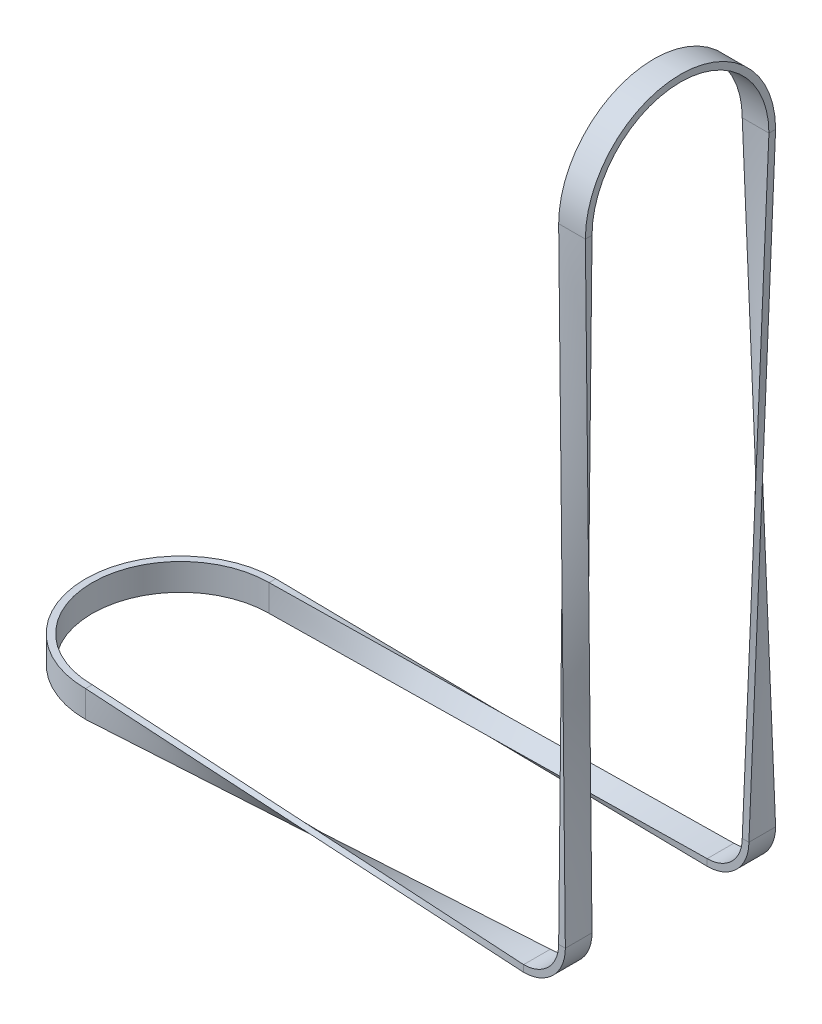
ISO-10303-21;
HEADER;
FILE_DESCRIPTION(('STEP AP214'),'2;1');
FILE_NAME('part.step','',(''),(''),'','','');
FILE_SCHEMA(('AUTOMOTIVE_DESIGN { 1 0 10303 214 1 1 1 1 }'));
ENDSEC;
DATA;
#1=APPLICATION_CONTEXT('core data for automotive mechanical design processes');
#2=APPLICATION_PROTOCOL_DEFINITION('international standard','automotive_design',2000,#1);
#3=PRODUCT_CONTEXT('',#1,'mechanical');
#4=PRODUCT('Part','Part','',(#3));
#5=PRODUCT_RELATED_PRODUCT_CATEGORY('part','',(#4));
#6=PRODUCT_DEFINITION_FORMATION('','',#4);
#7=PRODUCT_DEFINITION_CONTEXT('part definition',#1,'design');
#8=PRODUCT_DEFINITION('design','',#6,#7);
#9=PRODUCT_DEFINITION_SHAPE('','',#8);
#10=(LENGTH_UNIT() NAMED_UNIT(*) SI_UNIT(.MILLI.,.METRE.));
#11=(NAMED_UNIT(*) PLANE_ANGLE_UNIT() SI_UNIT($,.RADIAN.));
#12=(NAMED_UNIT(*) SI_UNIT($,.STERADIAN.) SOLID_ANGLE_UNIT());
#13=UNCERTAINTY_MEASURE_WITH_UNIT(LENGTH_MEASURE(1.E-05),#10,'distance_accuracy_value','');
#14=(GEOMETRIC_REPRESENTATION_CONTEXT(3) GLOBAL_UNCERTAINTY_ASSIGNED_CONTEXT((#13)) GLOBAL_UNIT_ASSIGNED_CONTEXT((#10,
#11,#12)) REPRESENTATION_CONTEXT('',''));
#15=CARTESIAN_POINT('',(0.,0.,0.));
#16=DIRECTION('',(0.,0.,1.));
#17=DIRECTION('',(1.,0.,0.));
#18=AXIS2_PLACEMENT_3D('',#15,#16,#17);
#19=CARTESIAN_POINT('',(-134.25,-7.50000000000001,28.5));
#20=CARTESIAN_POINT('',(0.,-12.5,31.5));
#21=CARTESIAN_POINT('',(-134.25,-8.83333333333334,28.5));
#22=CARTESIAN_POINT('',(0.,-12.5,30.1666666666667));
#23=CARTESIAN_POINT('',(-134.25,-10.1666666666667,28.5));
#24=CARTESIAN_POINT('',(0.,-12.5,28.8333333333333));
#25=CARTESIAN_POINT('',(-134.25,-12.8333333333333,28.5));
#26=CARTESIAN_POINT('',(0.,-12.5,26.1666666666667));
#27=CARTESIAN_POINT('',(-134.25,-14.1666666666667,28.5));
#28=CARTESIAN_POINT('',(0.,-12.5,24.8333333333333));
#29=CARTESIAN_POINT('',(-134.25,-15.5,28.5));
#30=CARTESIAN_POINT('',(0.,-12.5,23.5));
#31=B_SPLINE_SURFACE_WITH_KNOTS('',3,1,((#19,#20),(#21,#22),(#23,#24),(#25,#26),(#27,#28),(#29,
#30)),.UNSPECIFIED.,.F.,.F.,.F.,(4,2,4),(2,2),(0.,0.5,1.),(0.,1.),.UNSPECIFIED.);
#32=DIRECTION('',(0.,-1.,0.));
#33=VECTOR('',#32,1.);
#34=CARTESIAN_POINT('',(-134.25,-7.50000000000001,28.5));
#35=LINE('',#34,#33);
#36=CARTESIAN_POINT('',(-134.25,-7.50000000000001,28.5));
#37=VERTEX_POINT('',#36);
#38=CARTESIAN_POINT('',(-134.25,-10.5000000000001,28.5));
#39=VERTEX_POINT('',#38);
#40=EDGE_CURVE('E911',#37,#39,#35,.T.);
#41=DIRECTION('',(0.,1.,0.));
#42=VECTOR('',#41,1.);
#43=CARTESIAN_POINT('',(-134.25,-15.5,28.5));
#44=LINE('',#43,#42);
#45=CARTESIAN_POINT('',(-134.25,-15.5,28.5));
#46=VERTEX_POINT('',#45);
#47=EDGE_CURVE('E472',#46,#39,#44,.T.);
#48=DIRECTION('',(0.999058096523072,0.0223253205926944,-0.0372088676544906));
#49=VECTOR('',#48,1.);
#50=CARTESIAN_POINT('',(-67.125,-14.,26.));
#51=LINE('',#50,#49);
#52=CARTESIAN_POINT('',(0.,-12.5,23.5));
#53=VERTEX_POINT('',#52);
#54=EDGE_CURVE('E979',#46,#53,#51,.T.);
#55=DIRECTION('',(0.,0.,-1.));
#56=VECTOR('',#55,1.);
#57=CARTESIAN_POINT('',(0.,-12.5,31.5));
#58=LINE('',#57,#56);
#59=CARTESIAN_POINT('',(0.,-12.5,31.5));
#60=VERTEX_POINT('',#59);
#61=EDGE_CURVE('E386',#60,#53,#58,.T.);
#62=DIRECTION('',(-0.999058096523072,0.0372088676544905,-0.0223253205926943));
#63=VECTOR('',#62,1.);
#64=CARTESIAN_POINT('',(-67.125,-10.,30.));
#65=LINE('',#64,#63);
#66=EDGE_CURVE('E461',#60,#37,#65,.T.);
#67=ORIENTED_EDGE('',*,*,#40,.T.);
#68=ORIENTED_EDGE('',*,*,#47,.F.);
#69=ORIENTED_EDGE('',*,*,#54,.T.);
#70=ORIENTED_EDGE('',*,*,#61,.F.);
#71=ORIENTED_EDGE('',*,*,#66,.T.);
#72=EDGE_LOOP('',(#67,#68,#69,#70,#71));
#73=FACE_BOUND('',#72,.T.);
#74=ADVANCED_FACE('F49',(#73),#31,.T.);
#75=CARTESIAN_POINT('',(-134.25,-15.5,28.5));
#76=CARTESIAN_POINT('',(0.,-12.5,23.5));
#77=CARTESIAN_POINT('',(-134.25,-15.5,28.1666666666667));
#78=CARTESIAN_POINT('',(0.,-12.1666666666667,23.5));
#79=CARTESIAN_POINT('',(-134.25,-15.5,27.8333333333334));
#80=CARTESIAN_POINT('',(0.,-11.8333333333333,23.5));
#81=CARTESIAN_POINT('',(-134.25,-15.5,27.1666666666667));
#82=CARTESIAN_POINT('',(0.,-11.1666666666667,23.5));
#83=CARTESIAN_POINT('',(-134.25,-15.5,26.8333333333334));
#84=CARTESIAN_POINT('',(0.,-10.8333333333333,23.5));
#85=CARTESIAN_POINT('',(-134.25,-15.5,26.5));
#86=CARTESIAN_POINT('',(0.,-10.5,23.5));
#87=B_SPLINE_SURFACE_WITH_KNOTS('',3,1,((#75,#76),(#77,#78),(#79,#80),(#81,#82),(#83,#84),(#85,
#86)),.UNSPECIFIED.,.F.,.F.,.F.,(4,2,4),(2,2),(0.,0.5,1.),(0.,1.),.UNSPECIFIED.);
#88=DIRECTION('',(0.,0.,-1.));
#89=VECTOR('',#88,1.);
#90=CARTESIAN_POINT('',(-134.25,-15.5,28.5));
#91=LINE('',#90,#89);
#92=CARTESIAN_POINT('',(-134.25,-15.5,26.5));
#93=VERTEX_POINT('',#92);
#94=EDGE_CURVE('E902',#46,#93,#91,.T.);
#95=DIRECTION('',(0.999058096523072,0.0372088676544906,-0.0223253205926944));
#96=VECTOR('',#95,1.);
#97=CARTESIAN_POINT('',(-67.125,-13.,25.));
#98=LINE('',#97,#96);
#99=CARTESIAN_POINT('',(0.,-10.5,23.5));
#100=VERTEX_POINT('',#99);
#101=EDGE_CURVE('E977',#93,#100,#98,.T.);
#102=DIRECTION('',(0.,-1.,0.));
#103=VECTOR('',#102,1.);
#104=CARTESIAN_POINT('',(0.,-10.5,23.5));
#105=LINE('',#104,#103);
#106=EDGE_CURVE('E61',#100,#53,#105,.T.);
#107=ORIENTED_EDGE('',*,*,#94,.T.);
#108=ORIENTED_EDGE('',*,*,#101,.T.);
#109=ORIENTED_EDGE('',*,*,#106,.T.);
#110=ORIENTED_EDGE('',*,*,#54,.F.);
#111=EDGE_LOOP('',(#107,#108,#109,#110));
#112=FACE_BOUND('',#111,.T.);
#113=ADVANCED_FACE('F445',(#112),#87,.T.);
#114=CARTESIAN_POINT('',(-134.25,-7.50000000000001,26.5));
#115=CARTESIAN_POINT('',(0.,-10.5,31.5));
#116=CARTESIAN_POINT('',(-134.25,-7.50000000000001,26.8333333333333));
#117=CARTESIAN_POINT('',(0.,-10.8333333333333,31.5));
#118=CARTESIAN_POINT('',(-134.25,-7.50000000000001,27.1666666666667));
#119=CARTESIAN_POINT('',(0.,-11.1666666666667,31.5));
#120=CARTESIAN_POINT('',(-134.25,-7.50000000000001,27.8333333333333));
#121=CARTESIAN_POINT('',(0.,-11.8333333333333,31.5));
#122=CARTESIAN_POINT('',(-134.25,-7.50000000000001,28.1666666666667));
#123=CARTESIAN_POINT('',(0.,-12.1666666666667,31.5));
#124=CARTESIAN_POINT('',(-134.25,-7.50000000000001,28.5));
#125=CARTESIAN_POINT('',(0.,-12.5,31.5));
#126=B_SPLINE_SURFACE_WITH_KNOTS('',3,1,((#114,#115),(#116,#117),(#118,#119),(#120,#121),(#122,
#123),(#124,#125)),.UNSPECIFIED.,.F.,.F.,.F.,(4,2,4),(2,2),(0.,0.5,1.),(0.,1.),.UNSPECIFIED.);
#127=DIRECTION('',(0.,0.,-1.));
#128=VECTOR('',#127,1.);
#129=CARTESIAN_POINT('',(-134.25,-7.50000000000001,28.5));
#130=LINE('',#129,#128);
#131=CARTESIAN_POINT('',(-134.25,-7.50000000000001,26.5));
#132=VERTEX_POINT('',#131);
#133=EDGE_CURVE('E378',#37,#132,#130,.T.);
#134=DIRECTION('',(0.,-1.,0.));
#135=VECTOR('',#134,1.);
#136=CARTESIAN_POINT('',(0.,-10.5,31.5));
#137=LINE('',#136,#135);
#138=CARTESIAN_POINT('',(0.,-10.5,31.5));
#139=VERTEX_POINT('',#138);
#140=EDGE_CURVE('E390',#139,#60,#137,.T.);
#141=DIRECTION('',(0.999058096523072,-0.0223253205926943,0.0372088676544906));
#142=VECTOR('',#141,1.);
#143=CARTESIAN_POINT('',(-67.125,-9.00000000000001,29.));
#144=LINE('',#143,#142);
#145=EDGE_CURVE('E394',#132,#139,#144,.T.);
#146=ORIENTED_EDGE('',*,*,#133,.F.);
#147=ORIENTED_EDGE('',*,*,#66,.F.);
#148=ORIENTED_EDGE('',*,*,#140,.F.);
#149=ORIENTED_EDGE('',*,*,#145,.F.);
#150=EDGE_LOOP('',(#146,#147,#148,#149));
#151=FACE_BOUND('',#150,.T.);
#152=ADVANCED_FACE('F974',(#151),#126,.T.);
#153=CARTESIAN_POINT('',(-134.25,-15.5,26.5));
#154=CARTESIAN_POINT('',(0.,-10.5,23.5));
#155=CARTESIAN_POINT('',(-134.25,-14.1666666666667,26.5));
#156=CARTESIAN_POINT('',(0.,-10.5,24.8333333333333));
#157=CARTESIAN_POINT('',(-134.25,-12.8333333333333,26.5));
#158=CARTESIAN_POINT('',(0.,-10.5,26.1666666666666));
#159=CARTESIAN_POINT('',(-134.25,-10.1666666666667,26.5));
#160=CARTESIAN_POINT('',(0.,-10.5,28.8333333333333));
#161=CARTESIAN_POINT('',(-134.25,-8.83333333333335,26.5));
#162=CARTESIAN_POINT('',(0.,-10.5,30.1666666666666));
#163=CARTESIAN_POINT('',(-134.25,-7.50000000000001,26.5));
#164=CARTESIAN_POINT('',(0.,-10.5,31.5));
#165=B_SPLINE_SURFACE_WITH_KNOTS('',3,1,((#153,#154),(#155,#156),(#157,#158),(#159,#160),(#161,
#162),(#163,#164)),.UNSPECIFIED.,.F.,.F.,.F.,(4,2,4),(2,2),(0.,0.5,1.),(0.,1.),.UNSPECIFIED.);
#166=DIRECTION('',(0.,-1.,0.));
#167=VECTOR('',#166,1.);
#168=CARTESIAN_POINT('',(-134.25,-7.50000000000001,26.5));
#169=LINE('',#168,#167);
#170=CARTESIAN_POINT('',(-134.25,-12.5000000000001,26.5));
#171=VERTEX_POINT('',#170);
#172=EDGE_CURVE('E912',#132,#171,#169,.T.);
#173=DIRECTION('',(0.,0.,-1.));
#174=VECTOR('',#173,1.);
#175=CARTESIAN_POINT('',(0.,-10.5,31.5));
#176=LINE('',#175,#174);
#177=EDGE_CURVE('E12',#139,#100,#176,.T.);
#178=EDGE_CURVE('E483',#171,#93,#169,.T.);
#179=ORIENTED_EDGE('',*,*,#172,.F.);
#180=ORIENTED_EDGE('',*,*,#145,.T.);
#181=ORIENTED_EDGE('',*,*,#177,.T.);
#182=ORIENTED_EDGE('',*,*,#101,.F.);
#183=ORIENTED_EDGE('',*,*,#178,.F.);
#184=EDGE_LOOP('',(#179,#180,#181,#182,#183));
#185=FACE_BOUND('',#184,.T.);
#186=ADVANCED_FACE('F51',(#185),#165,.T.);
#187=CARTESIAN_POINT('',(0.,0.,27.5));
#188=DIRECTION('',(0.,0.,-1.));
#189=DIRECTION('',(-1.,0.,0.));
#190=AXIS2_PLACEMENT_3D('',#187,#188,#189);
#191=CYLINDRICAL_SURFACE('',#190,10.5);
#192=CARTESIAN_POINT('',(0.,0.,23.5));
#193=DIRECTION('',(0.,0.,-1.));
#194=DIRECTION('',(1.,0.,0.));
#195=AXIS2_PLACEMENT_3D('',#192,#193,#194);
#196=CIRCLE('',#195,10.5);
#197=CARTESIAN_POINT('',(10.5,0.,23.5));
#198=VERTEX_POINT('',#197);
#199=EDGE_CURVE('E353',#198,#100,#196,.T.);
#200=ORIENTED_EDGE('',*,*,#199,.T.);
#201=ORIENTED_EDGE('',*,*,#177,.F.);
#202=CARTESIAN_POINT('',(0.,0.,31.5));
#203=DIRECTION('',(0.,0.,-1.));
#204=DIRECTION('',(1.,0.,0.));
#205=AXIS2_PLACEMENT_3D('',#202,#203,#204);
#206=CIRCLE('',#205,10.5);
#207=CARTESIAN_POINT('',(10.5,0.,31.5));
#208=VERTEX_POINT('',#207);
#209=EDGE_CURVE('E356',#208,#139,#206,.T.);
#210=ORIENTED_EDGE('',*,*,#209,.F.);
#211=DIRECTION('',(0.,0.,-1.));
#212=VECTOR('',#211,1.);
#213=CARTESIAN_POINT('',(10.5,0.,31.5));
#214=LINE('',#213,#212);
#215=EDGE_CURVE('E197',#208,#198,#214,.T.);
#216=ORIENTED_EDGE('',*,*,#215,.T.);
#217=EDGE_LOOP('',(#200,#201,#210,#216));
#218=FACE_BOUND('',#217,.T.);
#219=ADVANCED_FACE('F301',(#218),#191,.F.);
#220=CARTESIAN_POINT('',(10.5,0.,23.5));
#221=DIRECTION('',(0.,0.,-1.));
#222=DIRECTION('',(-1.,0.,0.));
#223=AXIS2_PLACEMENT_3D('',#220,#221,#222);
#224=PLANE('',#223);
#225=CARTESIAN_POINT('',(0.,0.,23.5));
#226=DIRECTION('',(0.,0.,-1.));
#227=DIRECTION('',(1.,0.,0.));
#228=AXIS2_PLACEMENT_3D('',#225,#226,#227);
#229=CIRCLE('',#228,12.5);
#230=CARTESIAN_POINT('',(12.5,0.,23.5));
#231=VERTEX_POINT('',#230);
#232=EDGE_CURVE('E363',#231,#53,#229,.T.);
#233=ORIENTED_EDGE('',*,*,#232,.T.);
#234=ORIENTED_EDGE('',*,*,#106,.F.);
#235=ORIENTED_EDGE('',*,*,#199,.F.);
#236=DIRECTION('',(1.,0.,0.));
#237=VECTOR('',#236,1.);
#238=CARTESIAN_POINT('',(10.5,0.,23.5));
#239=LINE('',#238,#237);
#240=EDGE_CURVE('E328',#198,#231,#239,.T.);
#241=ORIENTED_EDGE('',*,*,#240,.T.);
#242=EDGE_LOOP('',(#233,#234,#235,#241));
#243=FACE_BOUND('',#242,.T.);
#244=ADVANCED_FACE('F360',(#243),#224,.T.);
#245=CARTESIAN_POINT('',(0.,0.,27.5));
#246=DIRECTION('',(0.,0.,-1.));
#247=DIRECTION('',(-1.,0.,0.));
#248=AXIS2_PLACEMENT_3D('',#245,#246,#247);
#249=CYLINDRICAL_SURFACE('',#248,12.5);
#250=CARTESIAN_POINT('',(0.,0.,31.5));
#251=DIRECTION('',(0.,0.,-1.));
#252=DIRECTION('',(1.,0.,0.));
#253=AXIS2_PLACEMENT_3D('',#250,#251,#252);
#254=CIRCLE('',#253,12.5);
#255=CARTESIAN_POINT('',(12.5,0.,31.5));
#256=VERTEX_POINT('',#255);
#257=EDGE_CURVE('E365',#256,#60,#254,.T.);
#258=ORIENTED_EDGE('',*,*,#257,.T.);
#259=ORIENTED_EDGE('',*,*,#61,.T.);
#260=ORIENTED_EDGE('',*,*,#232,.F.);
#261=DIRECTION('',(0.,0.,1.));
#262=VECTOR('',#261,1.);
#263=CARTESIAN_POINT('',(12.5,0.,23.5));
#264=LINE('',#263,#262);
#265=EDGE_CURVE('E348',#231,#256,#264,.T.);
#266=ORIENTED_EDGE('',*,*,#265,.T.);
#267=EDGE_LOOP('',(#258,#259,#260,#266));
#268=FACE_BOUND('',#267,.T.);
#269=ADVANCED_FACE('F427',(#268),#249,.T.);
#270=CARTESIAN_POINT('',(12.5,0.,31.5));
#271=DIRECTION('',(0.,0.,1.));
#272=DIRECTION('',(1.,0.,0.));
#273=AXIS2_PLACEMENT_3D('',#270,#271,#272);
#274=PLANE('',#273);
#275=ORIENTED_EDGE('',*,*,#140,.T.);
#276=ORIENTED_EDGE('',*,*,#257,.F.);
#277=DIRECTION('',(-1.,0.,0.));
#278=VECTOR('',#277,1.);
#279=CARTESIAN_POINT('',(12.5,0.,31.5));
#280=LINE('',#279,#278);
#281=EDGE_CURVE('E240',#256,#208,#280,.T.);
#282=ORIENTED_EDGE('',*,*,#281,.T.);
#283=ORIENTED_EDGE('',*,*,#209,.T.);
#284=EDGE_LOOP('',(#275,#276,#282,#283));
#285=FACE_BOUND('',#284,.T.);
#286=ADVANCED_FACE('F300',(#285),#274,.T.);
#287=CARTESIAN_POINT('',(12.5,0.,31.5));
#288=CARTESIAN_POINT('',(7.5,184.,28.5));
#289=CARTESIAN_POINT('',(12.5,0.,30.1666666666666));
#290=CARTESIAN_POINT('',(8.83333333333333,184.,28.5));
#291=CARTESIAN_POINT('',(12.5,0.,28.8333333333333));
#292=CARTESIAN_POINT('',(10.1666666666667,184.,28.5));
#293=CARTESIAN_POINT('',(12.5,0.,26.1666666666666));
#294=CARTESIAN_POINT('',(12.8333333333333,184.,28.5));
#295=CARTESIAN_POINT('',(12.5,0.,24.8333333333333));
#296=CARTESIAN_POINT('',(14.1666666666667,184.,28.5));
#297=CARTESIAN_POINT('',(12.5,0.,23.5));
#298=CARTESIAN_POINT('',(15.5,184.,28.5));
#299=B_SPLINE_SURFACE_WITH_KNOTS('',3,1,((#287,#288),(#289,#290),(#291,#292),(#293,#294),(#295,
#296),(#297,#298)),.UNSPECIFIED.,.F.,.F.,.F.,(4,2,4),(2,2),(0.,0.5,1.),(0.,1.),.UNSPECIFIED.);
#300=DIRECTION('',(0.0162961671395621,0.999498251226474,0.0271602785659368));
#301=VECTOR('',#300,1.);
#302=CARTESIAN_POINT('',(14.,92.,26.));
#303=LINE('',#302,#301);
#304=CARTESIAN_POINT('',(15.5,184.,28.5));
#305=VERTEX_POINT('',#304);
#306=EDGE_CURVE('E232',#231,#305,#303,.T.);
#307=DIRECTION('',(1.,0.,0.));
#308=VECTOR('',#307,1.);
#309=CARTESIAN_POINT('',(7.5,184.,28.5));
#310=LINE('',#309,#308);
#311=CARTESIAN_POINT('',(7.5,184.,28.5));
#312=VERTEX_POINT('',#311);
#313=EDGE_CURVE('E221',#312,#305,#310,.T.);
#314=DIRECTION('',(0.0271602785659368,-0.999498251226474,0.0162961671395621));
#315=VECTOR('',#314,1.);
#316=CARTESIAN_POINT('',(10.,92.,30.));
#317=LINE('',#316,#315);
#318=EDGE_CURVE('E220',#312,#256,#317,.T.);
#319=ORIENTED_EDGE('',*,*,#265,.F.);
#320=ORIENTED_EDGE('',*,*,#306,.T.);
#321=ORIENTED_EDGE('',*,*,#313,.F.);
#322=ORIENTED_EDGE('',*,*,#318,.T.);
#323=EDGE_LOOP('',(#319,#320,#321,#322));
#324=FACE_BOUND('',#323,.T.);
#325=ADVANCED_FACE('F289',(#324),#299,.T.);
#326=CARTESIAN_POINT('',(12.5,0.,23.5));
#327=CARTESIAN_POINT('',(15.5,184.,28.5));
#328=CARTESIAN_POINT('',(12.1666666666667,0.,23.5));
#329=CARTESIAN_POINT('',(15.5,184.,28.1666666666667));
#330=CARTESIAN_POINT('',(11.8333333333333,0.,23.5));
#331=CARTESIAN_POINT('',(15.5,184.,27.8333333333333));
#332=CARTESIAN_POINT('',(11.1666666666667,0.,23.5));
#333=CARTESIAN_POINT('',(15.5,184.,27.1666666666667));
#334=CARTESIAN_POINT('',(10.8333333333333,0.,23.5));
#335=CARTESIAN_POINT('',(15.5,184.,26.8333333333333));
#336=CARTESIAN_POINT('',(10.5,0.,23.5));
#337=CARTESIAN_POINT('',(15.5,184.,26.5));
#338=B_SPLINE_SURFACE_WITH_KNOTS('',3,1,((#326,#327),(#328,#329),(#330,#331),(#332,#333),(#334,
#335),(#336,#337)),.UNSPECIFIED.,.F.,.F.,.F.,(4,2,4),(2,2),(0.,0.5,1.),(0.,1.),.UNSPECIFIED.);
#339=DIRECTION('',(0.0271602785659368,0.999498251226474,0.0162961671395621));
#340=VECTOR('',#339,1.);
#341=CARTESIAN_POINT('',(13.,92.,25.));
#342=LINE('',#341,#340);
#343=CARTESIAN_POINT('',(15.5,184.,26.5));
#344=VERTEX_POINT('',#343);
#345=EDGE_CURVE('E229',#198,#344,#342,.T.);
#346=DIRECTION('',(0.,0.,1.));
#347=VECTOR('',#346,1.);
#348=CARTESIAN_POINT('',(15.5,184.,26.5));
#349=LINE('',#348,#347);
#350=EDGE_CURVE('E198',#344,#305,#349,.T.);
#351=ORIENTED_EDGE('',*,*,#240,.F.);
#352=ORIENTED_EDGE('',*,*,#345,.T.);
#353=ORIENTED_EDGE('',*,*,#350,.T.);
#354=ORIENTED_EDGE('',*,*,#306,.F.);
#355=EDGE_LOOP('',(#351,#352,#353,#354));
#356=FACE_BOUND('',#355,.T.);
#357=ADVANCED_FACE('F257',(#356),#338,.T.);
#358=CARTESIAN_POINT('',(10.5,0.,31.5));
#359=CARTESIAN_POINT('',(7.5,184.,26.5));
#360=CARTESIAN_POINT('',(10.8333333333333,0.,31.5));
#361=CARTESIAN_POINT('',(7.5,184.,26.8333333333333));
#362=CARTESIAN_POINT('',(11.1666666666667,0.,31.5));
#363=CARTESIAN_POINT('',(7.5,184.,27.1666666666666));
#364=CARTESIAN_POINT('',(11.8333333333333,0.,31.5));
#365=CARTESIAN_POINT('',(7.5,184.,27.8333333333333));
#366=CARTESIAN_POINT('',(12.1666666666667,0.,31.5));
#367=CARTESIAN_POINT('',(7.5,184.,28.1666666666667));
#368=CARTESIAN_POINT('',(12.5,0.,31.5));
#369=CARTESIAN_POINT('',(7.5,184.,28.5));
#370=B_SPLINE_SURFACE_WITH_KNOTS('',3,1,((#358,#359),(#360,#361),(#362,#363),(#364,#365),(#366,
#367),(#368,#369)),.UNSPECIFIED.,.F.,.F.,.F.,(4,2,4),(2,2),(0.,0.5,1.),(0.,1.),.UNSPECIFIED.);
#371=DIRECTION('',(0.,0.,1.));
#372=VECTOR('',#371,1.);
#373=CARTESIAN_POINT('',(7.5,184.,26.5));
#374=LINE('',#373,#372);
#375=CARTESIAN_POINT('',(7.5,184.,26.5));
#376=VERTEX_POINT('',#375);
#377=EDGE_CURVE('E206',#376,#312,#374,.T.);
#378=DIRECTION('',(-0.0162961671395621,0.999498251226474,-0.0271602785659368));
#379=VECTOR('',#378,1.);
#380=CARTESIAN_POINT('',(9.,92.,29.));
#381=LINE('',#380,#379);
#382=EDGE_CURVE('E217',#208,#376,#381,.T.);
#383=ORIENTED_EDGE('',*,*,#281,.F.);
#384=ORIENTED_EDGE('',*,*,#318,.F.);
#385=ORIENTED_EDGE('',*,*,#377,.F.);
#386=ORIENTED_EDGE('',*,*,#382,.F.);
#387=EDGE_LOOP('',(#383,#384,#385,#386));
#388=FACE_BOUND('',#387,.T.);
#389=ADVANCED_FACE('F216',(#388),#370,.T.);
#390=CARTESIAN_POINT('',(10.5,0.,23.5));
#391=CARTESIAN_POINT('',(15.5,184.,26.5));
#392=CARTESIAN_POINT('',(10.5,0.,24.8333333333333));
#393=CARTESIAN_POINT('',(14.1666666666667,184.,26.5));
#394=CARTESIAN_POINT('',(10.5,0.,26.1666666666666));
#395=CARTESIAN_POINT('',(12.8333333333333,184.,26.5));
#396=CARTESIAN_POINT('',(10.5,0.,28.8333333333333));
#397=CARTESIAN_POINT('',(10.1666666666667,184.,26.5));
#398=CARTESIAN_POINT('',(10.5,0.,30.1666666666666));
#399=CARTESIAN_POINT('',(8.83333333333333,184.,26.5));
#400=CARTESIAN_POINT('',(10.5,0.,31.5));
#401=CARTESIAN_POINT('',(7.5,184.,26.5));
#402=B_SPLINE_SURFACE_WITH_KNOTS('',3,1,((#390,#391),(#392,#393),(#394,#395),(#396,#397),(#398,
#399),(#400,#401)),.UNSPECIFIED.,.F.,.F.,.F.,(4,2,4),(2,2),(0.,0.5,1.),(0.,1.),.UNSPECIFIED.);
#403=DIRECTION('',(1.,0.,0.));
#404=VECTOR('',#403,1.);
#405=CARTESIAN_POINT('',(7.5,184.,26.5));
#406=LINE('',#405,#404);
#407=EDGE_CURVE('E184',#376,#344,#406,.T.);
#408=ORIENTED_EDGE('',*,*,#215,.F.);
#409=ORIENTED_EDGE('',*,*,#382,.T.);
#410=ORIENTED_EDGE('',*,*,#407,.T.);
#411=ORIENTED_EDGE('',*,*,#345,.F.);
#412=EDGE_LOOP('',(#408,#409,#410,#411));
#413=FACE_BOUND('',#412,.T.);
#414=ADVANCED_FACE('F225',(#413),#402,.T.);
#415=CARTESIAN_POINT('',(-134.25,-11.5,0.));
#416=DIRECTION('',(0.,-1.,0.));
#417=DIRECTION('',(0.,0.,-1.));
#418=AXIS2_PLACEMENT_3D('',#415,#416,#417);
#419=CYLINDRICAL_SURFACE('',#418,28.5);
#420=CARTESIAN_POINT('',(-134.25,-7.50000000000001,0.));
#421=DIRECTION('',(0.,-1.,0.));
#422=DIRECTION('',(0.,0.,1.));
#423=AXIS2_PLACEMENT_3D('',#420,#421,#422);
#424=CIRCLE('',#423,28.5);
#425=CARTESIAN_POINT('',(-134.25,-7.50000000000001,-28.5));
#426=VERTEX_POINT('',#425);
#427=EDGE_CURVE('E894',#37,#426,#424,.T.);
#428=ORIENTED_EDGE('',*,*,#427,.T.);
#429=DIRECTION('',(0.,-1.,0.));
#430=VECTOR('',#429,1.);
#431=CARTESIAN_POINT('',(-134.25,-7.50000000000001,-28.5));
#432=LINE('',#431,#430);
#433=CARTESIAN_POINT('',(-134.25,-10.5,-28.5));
#434=VERTEX_POINT('',#433);
#435=EDGE_CURVE('E69',#426,#434,#432,.T.);
#436=ORIENTED_EDGE('',*,*,#435,.T.);
#437=DIRECTION('',(0.,1.,0.));
#438=VECTOR('',#437,1.);
#439=CARTESIAN_POINT('',(-134.25,-15.5,-28.5));
#440=LINE('',#439,#438);
#441=CARTESIAN_POINT('',(-134.25,-15.5,-28.5));
#442=VERTEX_POINT('',#441);
#443=EDGE_CURVE('E741',#442,#434,#440,.T.);
#444=ORIENTED_EDGE('',*,*,#443,.F.);
#445=CARTESIAN_POINT('',(-134.25,-15.5,0.));
#446=DIRECTION('',(0.,-1.,0.));
#447=DIRECTION('',(0.,0.,1.));
#448=AXIS2_PLACEMENT_3D('',#445,#446,#447);
#449=CIRCLE('',#448,28.5);
#450=EDGE_CURVE('E891',#46,#442,#449,.T.);
#451=ORIENTED_EDGE('',*,*,#450,.F.);
#452=ORIENTED_EDGE('',*,*,#47,.T.);
#453=ORIENTED_EDGE('',*,*,#40,.F.);
#454=EDGE_LOOP('',(#428,#436,#444,#451,#452,#453));
#455=FACE_BOUND('',#454,.T.);
#456=ADVANCED_FACE('F636',(#455),#419,.T.);
#457=CARTESIAN_POINT('',(-134.25,-7.50000000000001,28.5));
#458=DIRECTION('',(0.,1.,0.));
#459=DIRECTION('',(0.,0.,1.));
#460=AXIS2_PLACEMENT_3D('',#457,#458,#459);
#461=PLANE('',#460);
#462=CARTESIAN_POINT('',(-134.25,-7.50000000000001,0.));
#463=DIRECTION('',(0.,-1.,0.));
#464=DIRECTION('',(0.,0.,1.));
#465=AXIS2_PLACEMENT_3D('',#462,#463,#464);
#466=CIRCLE('',#465,26.5);
#467=CARTESIAN_POINT('',(-134.25,-7.50000000000001,-26.5));
#468=VERTEX_POINT('',#467);
#469=EDGE_CURVE('E933',#132,#468,#466,.T.);
#470=ORIENTED_EDGE('',*,*,#469,.T.);
#471=DIRECTION('',(0.,0.,1.));
#472=VECTOR('',#471,1.);
#473=CARTESIAN_POINT('',(-134.25,-7.50000000000001,-28.5));
#474=LINE('',#473,#472);
#475=EDGE_CURVE('E873',#426,#468,#474,.T.);
#476=ORIENTED_EDGE('',*,*,#475,.F.);
#477=ORIENTED_EDGE('',*,*,#427,.F.);
#478=ORIENTED_EDGE('',*,*,#133,.T.);
#479=EDGE_LOOP('',(#470,#476,#477,#478));
#480=FACE_BOUND('',#479,.T.);
#481=ADVANCED_FACE('F498',(#480),#461,.T.);
#482=CARTESIAN_POINT('',(-134.25,-11.5,0.));
#483=DIRECTION('',(0.,-1.,0.));
#484=DIRECTION('',(0.,0.,-1.));
#485=AXIS2_PLACEMENT_3D('',#482,#483,#484);
#486=CYLINDRICAL_SURFACE('',#485,26.5);
#487=CARTESIAN_POINT('',(-134.25,-15.5,0.));
#488=DIRECTION('',(0.,-1.,0.));
#489=DIRECTION('',(0.,0.,1.));
#490=AXIS2_PLACEMENT_3D('',#487,#488,#489);
#491=CIRCLE('',#490,26.5);
#492=CARTESIAN_POINT('',(-134.25,-15.5,-26.5));
#493=VERTEX_POINT('',#492);
#494=EDGE_CURVE('E474',#93,#493,#491,.T.);
#495=ORIENTED_EDGE('',*,*,#494,.T.);
#496=DIRECTION('',(0.,-1.,0.));
#497=VECTOR('',#496,1.);
#498=CARTESIAN_POINT('',(-134.25,-7.50000000000001,-26.5));
#499=LINE('',#498,#497);
#500=CARTESIAN_POINT('',(-134.25,-12.5,-26.5));
#501=VERTEX_POINT('',#500);
#502=EDGE_CURVE('E78',#501,#493,#499,.T.);
#503=ORIENTED_EDGE('',*,*,#502,.F.);
#504=DIRECTION('',(0.,-1.,0.));
#505=VECTOR('',#504,1.);
#506=CARTESIAN_POINT('',(-134.25,-7.50000000000001,-26.5));
#507=LINE('',#506,#505);
#508=EDGE_CURVE('E477',#468,#501,#507,.T.);
#509=ORIENTED_EDGE('',*,*,#508,.F.);
#510=ORIENTED_EDGE('',*,*,#469,.F.);
#511=ORIENTED_EDGE('',*,*,#172,.T.);
#512=ORIENTED_EDGE('',*,*,#178,.T.);
#513=EDGE_LOOP('',(#495,#503,#509,#510,#511,#512));
#514=FACE_BOUND('',#513,.T.);
#515=ADVANCED_FACE('F489',(#514),#486,.F.);
#516=CARTESIAN_POINT('',(-134.25,-15.5,26.5));
#517=DIRECTION('',(0.,-1.,0.));
#518=DIRECTION('',(0.,0.,-1.));
#519=AXIS2_PLACEMENT_3D('',#516,#517,#518);
#520=PLANE('',#519);
#521=DIRECTION('',(0.,0.,-1.));
#522=VECTOR('',#521,1.);
#523=CARTESIAN_POINT('',(-134.25,-15.5,-26.5));
#524=LINE('',#523,#522);
#525=EDGE_CURVE('E476',#493,#442,#524,.T.);
#526=ORIENTED_EDGE('',*,*,#525,.F.);
#527=ORIENTED_EDGE('',*,*,#494,.F.);
#528=ORIENTED_EDGE('',*,*,#94,.F.);
#529=ORIENTED_EDGE('',*,*,#450,.T.);
#530=EDGE_LOOP('',(#526,#527,#528,#529));
#531=FACE_BOUND('',#530,.T.);
#532=ADVANCED_FACE('F302',(#531),#520,.T.);
#533=CARTESIAN_POINT('',(-134.25,-7.50000000000001,-28.5));
#534=CARTESIAN_POINT('',(0.,-12.5,-31.5));
#535=CARTESIAN_POINT('',(-134.25,-8.83333333333334,-28.5));
#536=CARTESIAN_POINT('',(0.,-12.5,-30.1666666666667));
#537=CARTESIAN_POINT('',(-134.25,-10.1666666666667,-28.5));
#538=CARTESIAN_POINT('',(0.,-12.5,-28.8333333333333));
#539=CARTESIAN_POINT('',(-134.25,-12.8333333333333,-28.5));
#540=CARTESIAN_POINT('',(0.,-12.5,-26.1666666666667));
#541=CARTESIAN_POINT('',(-134.25,-14.1666666666667,-28.5));
#542=CARTESIAN_POINT('',(0.,-12.5,-24.8333333333333));
#543=CARTESIAN_POINT('',(-134.25,-15.5,-28.5));
#544=CARTESIAN_POINT('',(0.,-12.5,-23.5));
#545=B_SPLINE_SURFACE_WITH_KNOTS('',3,1,((#533,#534),(#535,#536),(#537,#538),(#539,#540),(#541,
#542),(#543,#544)),.UNSPECIFIED.,.F.,.F.,.F.,(4,2,4),(2,2),(0.,0.5,1.),(0.,1.),.UNSPECIFIED.);
#546=DIRECTION('',(-0.999058096523072,0.0372088676544905,0.0223253205926943));
#547=VECTOR('',#546,1.);
#548=CARTESIAN_POINT('',(-67.125,-10.,-30.));
#549=LINE('',#548,#547);
#550=CARTESIAN_POINT('',(0.,-12.5,-31.5));
#551=VERTEX_POINT('',#550);
#552=EDGE_CURVE('E651',#551,#426,#549,.T.);
#553=DIRECTION('',(0.,0.,1.));
#554=VECTOR('',#553,1.);
#555=CARTESIAN_POINT('',(0.,-12.5,-31.5));
#556=LINE('',#555,#554);
#557=CARTESIAN_POINT('',(0.,-12.5,-23.5));
#558=VERTEX_POINT('',#557);
#559=EDGE_CURVE('E551',#551,#558,#556,.T.);
#560=DIRECTION('',(0.999058096523072,0.0223253205926944,0.0372088676544906));
#561=VECTOR('',#560,1.);
#562=CARTESIAN_POINT('',(-67.125,-14.,-26.));
#563=LINE('',#562,#561);
#564=EDGE_CURVE('E660',#442,#558,#563,.T.);
#565=ORIENTED_EDGE('',*,*,#435,.F.);
#566=ORIENTED_EDGE('',*,*,#552,.F.);
#567=ORIENTED_EDGE('',*,*,#559,.T.);
#568=ORIENTED_EDGE('',*,*,#564,.F.);
#569=ORIENTED_EDGE('',*,*,#443,.T.);
#570=EDGE_LOOP('',(#565,#566,#567,#568,#569));
#571=FACE_BOUND('',#570,.T.);
#572=ADVANCED_FACE('F628',(#571),#545,.F.);
#573=CARTESIAN_POINT('',(-134.25,-15.5,-28.5));
#574=CARTESIAN_POINT('',(0.,-12.5,-23.5));
#575=CARTESIAN_POINT('',(-134.25,-15.5,-28.1666666666667));
#576=CARTESIAN_POINT('',(0.,-12.1666666666667,-23.5));
#577=CARTESIAN_POINT('',(-134.25,-15.5,-27.8333333333334));
#578=CARTESIAN_POINT('',(0.,-11.8333333333333,-23.5));
#579=CARTESIAN_POINT('',(-134.25,-15.5,-27.1666666666667));
#580=CARTESIAN_POINT('',(0.,-11.1666666666667,-23.5));
#581=CARTESIAN_POINT('',(-134.25,-15.5,-26.8333333333334));
#582=CARTESIAN_POINT('',(0.,-10.8333333333333,-23.5));
#583=CARTESIAN_POINT('',(-134.25,-15.5,-26.5));
#584=CARTESIAN_POINT('',(0.,-10.5,-23.5));
#585=B_SPLINE_SURFACE_WITH_KNOTS('',3,1,((#573,#574),(#575,#576),(#577,#578),(#579,#580),(#581,
#582),(#583,#584)),.UNSPECIFIED.,.F.,.F.,.F.,(4,2,4),(2,2),(0.,0.5,1.),(0.,1.),.UNSPECIFIED.);
#586=DIRECTION('',(0.,-1.,0.));
#587=VECTOR('',#586,1.);
#588=CARTESIAN_POINT('',(0.,-10.5,-23.5));
#589=LINE('',#588,#587);
#590=CARTESIAN_POINT('',(0.,-10.5,-23.5));
#591=VERTEX_POINT('',#590);
#592=EDGE_CURVE('E546',#591,#558,#589,.T.);
#593=DIRECTION('',(0.999058096523072,0.0372088676544906,0.0223253205926944));
#594=VECTOR('',#593,1.);
#595=CARTESIAN_POINT('',(-67.125,-13.,-25.));
#596=LINE('',#595,#594);
#597=EDGE_CURVE('E665',#493,#591,#596,.T.);
#598=ORIENTED_EDGE('',*,*,#525,.T.);
#599=ORIENTED_EDGE('',*,*,#564,.T.);
#600=ORIENTED_EDGE('',*,*,#592,.F.);
#601=ORIENTED_EDGE('',*,*,#597,.F.);
#602=EDGE_LOOP('',(#598,#599,#600,#601));
#603=FACE_BOUND('',#602,.T.);
#604=ADVANCED_FACE('F634',(#603),#585,.F.);
#605=CARTESIAN_POINT('',(-134.25,-7.50000000000001,-26.5));
#606=CARTESIAN_POINT('',(0.,-10.5,-31.5));
#607=CARTESIAN_POINT('',(-134.25,-7.50000000000001,-26.8333333333333));
#608=CARTESIAN_POINT('',(0.,-10.8333333333333,-31.5));
#609=CARTESIAN_POINT('',(-134.25,-7.50000000000001,-27.1666666666667));
#610=CARTESIAN_POINT('',(0.,-11.1666666666667,-31.5));
#611=CARTESIAN_POINT('',(-134.25,-7.50000000000001,-27.8333333333333));
#612=CARTESIAN_POINT('',(0.,-11.8333333333333,-31.5));
#613=CARTESIAN_POINT('',(-134.25,-7.50000000000001,-28.1666666666667));
#614=CARTESIAN_POINT('',(0.,-12.1666666666667,-31.5));
#615=CARTESIAN_POINT('',(-134.25,-7.50000000000001,-28.5));
#616=CARTESIAN_POINT('',(0.,-12.5,-31.5));
#617=B_SPLINE_SURFACE_WITH_KNOTS('',3,1,((#605,#606),(#607,#608),(#609,#610),(#611,#612),(#613,
#614),(#615,#616)),.UNSPECIFIED.,.F.,.F.,.F.,(4,2,4),(2,2),(0.,0.5,1.),(0.,1.),.UNSPECIFIED.);
#618=DIRECTION('',(0.999058096523072,-0.0223253205926943,-0.0372088676544906));
#619=VECTOR('',#618,1.);
#620=CARTESIAN_POINT('',(-67.125,-9.00000000000001,-29.));
#621=LINE('',#620,#619);
#622=CARTESIAN_POINT('',(0.,-10.5,-31.5));
#623=VERTEX_POINT('',#622);
#624=EDGE_CURVE('E561',#468,#623,#621,.T.);
#625=DIRECTION('',(0.,-1.,0.));
#626=VECTOR('',#625,1.);
#627=CARTESIAN_POINT('',(0.,-10.5,-31.5));
#628=LINE('',#627,#626);
#629=EDGE_CURVE('E556',#623,#551,#628,.T.);
#630=ORIENTED_EDGE('',*,*,#475,.T.);
#631=ORIENTED_EDGE('',*,*,#624,.T.);
#632=ORIENTED_EDGE('',*,*,#629,.T.);
#633=ORIENTED_EDGE('',*,*,#552,.T.);
#634=EDGE_LOOP('',(#630,#631,#632,#633));
#635=FACE_BOUND('',#634,.T.);
#636=ADVANCED_FACE('F704',(#635),#617,.F.);
#637=CARTESIAN_POINT('',(-134.25,-15.5,-26.5));
#638=CARTESIAN_POINT('',(0.,-10.5,-23.5));
#639=CARTESIAN_POINT('',(-134.25,-14.1666666666667,-26.5));
#640=CARTESIAN_POINT('',(0.,-10.5,-24.8333333333333));
#641=CARTESIAN_POINT('',(-134.25,-12.8333333333333,-26.5));
#642=CARTESIAN_POINT('',(0.,-10.5,-26.1666666666666));
#643=CARTESIAN_POINT('',(-134.25,-10.1666666666667,-26.5));
#644=CARTESIAN_POINT('',(0.,-10.5,-28.8333333333333));
#645=CARTESIAN_POINT('',(-134.25,-8.83333333333335,-26.5));
#646=CARTESIAN_POINT('',(0.,-10.5,-30.1666666666666));
#647=CARTESIAN_POINT('',(-134.25,-7.50000000000001,-26.5));
#648=CARTESIAN_POINT('',(0.,-10.5,-31.5));
#649=B_SPLINE_SURFACE_WITH_KNOTS('',3,1,((#637,#638),(#639,#640),(#641,#642),(#643,#644),(#645,
#646),(#647,#648)),.UNSPECIFIED.,.F.,.F.,.F.,(4,2,4),(2,2),(0.,0.5,1.),(0.,1.),.UNSPECIFIED.);
#650=DIRECTION('',(0.,0.,1.));
#651=VECTOR('',#650,1.);
#652=CARTESIAN_POINT('',(0.,-10.5,-31.5));
#653=LINE('',#652,#651);
#654=EDGE_CURVE('E543',#623,#591,#653,.T.);
#655=ORIENTED_EDGE('',*,*,#508,.T.);
#656=ORIENTED_EDGE('',*,*,#502,.T.);
#657=ORIENTED_EDGE('',*,*,#597,.T.);
#658=ORIENTED_EDGE('',*,*,#654,.F.);
#659=ORIENTED_EDGE('',*,*,#624,.F.);
#660=EDGE_LOOP('',(#655,#656,#657,#658,#659));
#661=FACE_BOUND('',#660,.T.);
#662=ADVANCED_FACE('F693',(#661),#649,.F.);
#663=CARTESIAN_POINT('',(0.,0.,-27.5));
#664=DIRECTION('',(0.,0.,1.));
#665=DIRECTION('',(-1.,0.,0.));
#666=AXIS2_PLACEMENT_3D('',#663,#664,#665);
#667=CYLINDRICAL_SURFACE('',#666,10.5);
#668=CARTESIAN_POINT('',(0.,0.,-23.5));
#669=DIRECTION('',(0.,0.,-1.));
#670=DIRECTION('',(1.,0.,0.));
#671=AXIS2_PLACEMENT_3D('',#668,#669,#670);
#672=CIRCLE('',#671,10.5);
#673=CARTESIAN_POINT('',(10.5,0.,-23.5));
#674=VERTEX_POINT('',#673);
#675=EDGE_CURVE('E527',#674,#591,#672,.T.);
#676=ORIENTED_EDGE('',*,*,#675,.F.);
#677=DIRECTION('',(0.,0.,1.));
#678=VECTOR('',#677,1.);
#679=CARTESIAN_POINT('',(10.5,0.,-31.5));
#680=LINE('',#679,#678);
#681=CARTESIAN_POINT('',(10.5,0.,-31.5));
#682=VERTEX_POINT('',#681);
#683=EDGE_CURVE('E577',#682,#674,#680,.T.);
#684=ORIENTED_EDGE('',*,*,#683,.F.);
#685=CARTESIAN_POINT('',(0.,0.,-31.5));
#686=DIRECTION('',(0.,0.,-1.));
#687=DIRECTION('',(1.,0.,0.));
#688=AXIS2_PLACEMENT_3D('',#685,#686,#687);
#689=CIRCLE('',#688,10.5);
#690=EDGE_CURVE('E530',#682,#623,#689,.T.);
#691=ORIENTED_EDGE('',*,*,#690,.T.);
#692=ORIENTED_EDGE('',*,*,#654,.T.);
#693=EDGE_LOOP('',(#676,#684,#691,#692));
#694=FACE_BOUND('',#693,.T.);
#695=ADVANCED_FACE('F703',(#694),#667,.F.);
#696=CARTESIAN_POINT('',(10.5,0.,-23.5));
#697=DIRECTION('',(0.,0.,1.));
#698=DIRECTION('',(-1.,0.,0.));
#699=AXIS2_PLACEMENT_3D('',#696,#697,#698);
#700=PLANE('',#699);
#701=CARTESIAN_POINT('',(0.,0.,-23.5));
#702=DIRECTION('',(0.,0.,-1.));
#703=DIRECTION('',(1.,0.,0.));
#704=AXIS2_PLACEMENT_3D('',#701,#702,#703);
#705=CIRCLE('',#704,12.5);
#706=CARTESIAN_POINT('',(12.5,0.,-23.5));
#707=VERTEX_POINT('',#706);
#708=EDGE_CURVE('E529',#707,#558,#705,.T.);
#709=ORIENTED_EDGE('',*,*,#708,.F.);
#710=DIRECTION('',(1.,0.,0.));
#711=VECTOR('',#710,1.);
#712=CARTESIAN_POINT('',(10.5,0.,-23.5));
#713=LINE('',#712,#711);
#714=EDGE_CURVE('E567',#674,#707,#713,.T.);
#715=ORIENTED_EDGE('',*,*,#714,.F.);
#716=ORIENTED_EDGE('',*,*,#675,.T.);
#717=ORIENTED_EDGE('',*,*,#592,.T.);
#718=EDGE_LOOP('',(#709,#715,#716,#717));
#719=FACE_BOUND('',#718,.T.);
#720=ADVANCED_FACE('F621',(#719),#700,.T.);
#721=CARTESIAN_POINT('',(0.,0.,-27.5));
#722=DIRECTION('',(0.,0.,1.));
#723=DIRECTION('',(-1.,0.,0.));
#724=AXIS2_PLACEMENT_3D('',#721,#722,#723);
#725=CYLINDRICAL_SURFACE('',#724,12.5);
#726=CARTESIAN_POINT('',(0.,0.,-31.5));
#727=DIRECTION('',(0.,0.,-1.));
#728=DIRECTION('',(1.,0.,0.));
#729=AXIS2_PLACEMENT_3D('',#726,#727,#728);
#730=CIRCLE('',#729,12.5);
#731=CARTESIAN_POINT('',(12.5,0.,-31.5));
#732=VERTEX_POINT('',#731);
#733=EDGE_CURVE('E521',#732,#551,#730,.T.);
#734=ORIENTED_EDGE('',*,*,#733,.F.);
#735=DIRECTION('',(0.,0.,-1.));
#736=VECTOR('',#735,1.);
#737=CARTESIAN_POINT('',(12.5,0.,-23.5));
#738=LINE('',#737,#736);
#739=EDGE_CURVE('E564',#707,#732,#738,.T.);
#740=ORIENTED_EDGE('',*,*,#739,.F.);
#741=ORIENTED_EDGE('',*,*,#708,.T.);
#742=ORIENTED_EDGE('',*,*,#559,.F.);
#743=EDGE_LOOP('',(#734,#740,#741,#742));
#744=FACE_BOUND('',#743,.T.);
#745=ADVANCED_FACE('F612',(#744),#725,.T.);
#746=CARTESIAN_POINT('',(12.5,0.,-31.5));
#747=DIRECTION('',(0.,0.,-1.));
#748=DIRECTION('',(1.,0.,0.));
#749=AXIS2_PLACEMENT_3D('',#746,#747,#748);
#750=PLANE('',#749);
#751=ORIENTED_EDGE('',*,*,#629,.F.);
#752=ORIENTED_EDGE('',*,*,#690,.F.);
#753=DIRECTION('',(-1.,0.,0.));
#754=VECTOR('',#753,1.);
#755=CARTESIAN_POINT('',(12.5,0.,-31.5));
#756=LINE('',#755,#754);
#757=EDGE_CURVE('E534',#732,#682,#756,.T.);
#758=ORIENTED_EDGE('',*,*,#757,.F.);
#759=ORIENTED_EDGE('',*,*,#733,.T.);
#760=EDGE_LOOP('',(#751,#752,#758,#759));
#761=FACE_BOUND('',#760,.T.);
#762=ADVANCED_FACE('F620',(#761),#750,.T.);
#763=CARTESIAN_POINT('',(12.5,0.,-31.5));
#764=CARTESIAN_POINT('',(7.5,184.,-28.5));
#765=CARTESIAN_POINT('',(12.5,0.,-30.1666666666666));
#766=CARTESIAN_POINT('',(8.83333333333333,184.,-28.5));
#767=CARTESIAN_POINT('',(12.5,0.,-28.8333333333333));
#768=CARTESIAN_POINT('',(10.1666666666667,184.,-28.5));
#769=CARTESIAN_POINT('',(12.5,0.,-26.1666666666666));
#770=CARTESIAN_POINT('',(12.8333333333333,184.,-28.5));
#771=CARTESIAN_POINT('',(12.5,0.,-24.8333333333333));
#772=CARTESIAN_POINT('',(14.1666666666667,184.,-28.5));
#773=CARTESIAN_POINT('',(12.5,0.,-23.5));
#774=CARTESIAN_POINT('',(15.5,184.,-28.5));
#775=B_SPLINE_SURFACE_WITH_KNOTS('',3,1,((#763,#764),(#765,#766),(#767,#768),(#769,#770),(#771,
#772),(#773,#774)),.UNSPECIFIED.,.F.,.F.,.F.,(4,2,4),(2,2),(0.,0.5,1.),(0.,1.),.UNSPECIFIED.);
#776=DIRECTION('',(0.0271602785659368,-0.999498251226474,-0.0162961671395621));
#777=VECTOR('',#776,1.);
#778=CARTESIAN_POINT('',(10.,92.,-30.));
#779=LINE('',#778,#777);
#780=CARTESIAN_POINT('',(7.5,184.,-28.5));
#781=VERTEX_POINT('',#780);
#782=EDGE_CURVE('E753',#781,#732,#779,.T.);
#783=DIRECTION('',(1.,0.,0.));
#784=VECTOR('',#783,1.);
#785=CARTESIAN_POINT('',(7.5,184.,-28.5));
#786=LINE('',#785,#784);
#787=CARTESIAN_POINT('',(15.5,184.,-28.5));
#788=VERTEX_POINT('',#787);
#789=EDGE_CURVE('E783',#781,#788,#786,.T.);
#790=DIRECTION('',(0.0162961671395621,0.999498251226474,-0.0271602785659368));
#791=VECTOR('',#790,1.);
#792=CARTESIAN_POINT('',(14.,92.,-26.));
#793=LINE('',#792,#791);
#794=EDGE_CURVE('E779',#707,#788,#793,.T.);
#795=ORIENTED_EDGE('',*,*,#739,.T.);
#796=ORIENTED_EDGE('',*,*,#782,.F.);
#797=ORIENTED_EDGE('',*,*,#789,.T.);
#798=ORIENTED_EDGE('',*,*,#794,.F.);
#799=EDGE_LOOP('',(#795,#796,#797,#798));
#800=FACE_BOUND('',#799,.T.);
#801=ADVANCED_FACE('F626',(#800),#775,.F.);
#802=CARTESIAN_POINT('',(12.5,0.,-23.5));
#803=CARTESIAN_POINT('',(15.5,184.,-28.5));
#804=CARTESIAN_POINT('',(12.1666666666667,0.,-23.5));
#805=CARTESIAN_POINT('',(15.5,184.,-28.1666666666667));
#806=CARTESIAN_POINT('',(11.8333333333333,0.,-23.5));
#807=CARTESIAN_POINT('',(15.5,184.,-27.8333333333333));
#808=CARTESIAN_POINT('',(11.1666666666667,0.,-23.5));
#809=CARTESIAN_POINT('',(15.5,184.,-27.1666666666667));
#810=CARTESIAN_POINT('',(10.8333333333333,0.,-23.5));
#811=CARTESIAN_POINT('',(15.5,184.,-26.8333333333333));
#812=CARTESIAN_POINT('',(10.5,0.,-23.5));
#813=CARTESIAN_POINT('',(15.5,184.,-26.5));
#814=B_SPLINE_SURFACE_WITH_KNOTS('',3,1,((#802,#803),(#804,#805),(#806,#807),(#808,#809),(#810,
#811),(#812,#813)),.UNSPECIFIED.,.F.,.F.,.F.,(4,2,4),(2,2),(0.,0.5,1.),(0.,1.),.UNSPECIFIED.);
#815=DIRECTION('',(0.,0.,-1.));
#816=VECTOR('',#815,1.);
#817=CARTESIAN_POINT('',(15.5,184.,-26.5));
#818=LINE('',#817,#816);
#819=CARTESIAN_POINT('',(15.5,184.,-26.5));
#820=VERTEX_POINT('',#819);
#821=EDGE_CURVE('E768',#820,#788,#818,.T.);
#822=DIRECTION('',(0.0271602785659368,0.999498251226474,-0.0162961671395621));
#823=VECTOR('',#822,1.);
#824=CARTESIAN_POINT('',(13.,92.,-25.));
#825=LINE('',#824,#823);
#826=EDGE_CURVE('E773',#674,#820,#825,.T.);
#827=ORIENTED_EDGE('',*,*,#714,.T.);
#828=ORIENTED_EDGE('',*,*,#794,.T.);
#829=ORIENTED_EDGE('',*,*,#821,.F.);
#830=ORIENTED_EDGE('',*,*,#826,.F.);
#831=EDGE_LOOP('',(#827,#828,#829,#830));
#832=FACE_BOUND('',#831,.T.);
#833=ADVANCED_FACE('F781',(#832),#814,.F.);
#834=CARTESIAN_POINT('',(10.5,0.,-31.5));
#835=CARTESIAN_POINT('',(7.5,184.,-26.5));
#836=CARTESIAN_POINT('',(10.8333333333333,0.,-31.5));
#837=CARTESIAN_POINT('',(7.5,184.,-26.8333333333333));
#838=CARTESIAN_POINT('',(11.1666666666667,0.,-31.5));
#839=CARTESIAN_POINT('',(7.5,184.,-27.1666666666666));
#840=CARTESIAN_POINT('',(11.8333333333333,0.,-31.5));
#841=CARTESIAN_POINT('',(7.5,184.,-27.8333333333333));
#842=CARTESIAN_POINT('',(12.1666666666667,0.,-31.5));
#843=CARTESIAN_POINT('',(7.5,184.,-28.1666666666667));
#844=CARTESIAN_POINT('',(12.5,0.,-31.5));
#845=CARTESIAN_POINT('',(7.5,184.,-28.5));
#846=B_SPLINE_SURFACE_WITH_KNOTS('',3,1,((#834,#835),(#836,#837),(#838,#839),(#840,#841),(#842,
#843),(#844,#845)),.UNSPECIFIED.,.F.,.F.,.F.,(4,2,4),(2,2),(0.,0.5,1.),(0.,1.),.UNSPECIFIED.);
#847=DIRECTION('',(-0.0162961671395621,0.999498251226474,0.0271602785659368));
#848=VECTOR('',#847,1.);
#849=CARTESIAN_POINT('',(9.,92.,-29.));
#850=LINE('',#849,#848);
#851=CARTESIAN_POINT('',(7.5,184.,-26.5));
#852=VERTEX_POINT('',#851);
#853=EDGE_CURVE('E778',#682,#852,#850,.T.);
#854=DIRECTION('',(0.,0.,-1.));
#855=VECTOR('',#854,1.);
#856=CARTESIAN_POINT('',(7.5,184.,-26.5));
#857=LINE('',#856,#855);
#858=EDGE_CURVE('E210',#852,#781,#857,.T.);
#859=ORIENTED_EDGE('',*,*,#757,.T.);
#860=ORIENTED_EDGE('',*,*,#853,.T.);
#861=ORIENTED_EDGE('',*,*,#858,.T.);
#862=ORIENTED_EDGE('',*,*,#782,.T.);
#863=EDGE_LOOP('',(#859,#860,#861,#862));
#864=FACE_BOUND('',#863,.T.);
#865=ADVANCED_FACE('F1183',(#864),#846,.F.);
#866=CARTESIAN_POINT('',(10.5,0.,-23.5));
#867=CARTESIAN_POINT('',(15.5,184.,-26.5));
#868=CARTESIAN_POINT('',(10.5,0.,-24.8333333333333));
#869=CARTESIAN_POINT('',(14.1666666666667,184.,-26.5));
#870=CARTESIAN_POINT('',(10.5,0.,-26.1666666666666));
#871=CARTESIAN_POINT('',(12.8333333333333,184.,-26.5));
#872=CARTESIAN_POINT('',(10.5,0.,-28.8333333333333));
#873=CARTESIAN_POINT('',(10.1666666666667,184.,-26.5));
#874=CARTESIAN_POINT('',(10.5,0.,-30.1666666666666));
#875=CARTESIAN_POINT('',(8.83333333333333,184.,-26.5));
#876=CARTESIAN_POINT('',(10.5,0.,-31.5));
#877=CARTESIAN_POINT('',(7.5,184.,-26.5));
#878=B_SPLINE_SURFACE_WITH_KNOTS('',3,1,((#866,#867),(#868,#869),(#870,#871),(#872,#873),(#874,
#875),(#876,#877)),.UNSPECIFIED.,.F.,.F.,.F.,(4,2,4),(2,2),(0.,0.5,1.),(0.,1.),.UNSPECIFIED.);
#879=DIRECTION('',(1.,0.,0.));
#880=VECTOR('',#879,1.);
#881=CARTESIAN_POINT('',(7.5,184.,-26.5));
#882=LINE('',#881,#880);
#883=EDGE_CURVE('E588',#852,#820,#882,.T.);
#884=ORIENTED_EDGE('',*,*,#683,.T.);
#885=ORIENTED_EDGE('',*,*,#826,.T.);
#886=ORIENTED_EDGE('',*,*,#883,.F.);
#887=ORIENTED_EDGE('',*,*,#853,.F.);
#888=EDGE_LOOP('',(#884,#885,#886,#887));
#889=FACE_BOUND('',#888,.T.);
#890=ADVANCED_FACE('F774',(#889),#878,.F.);
#891=CARTESIAN_POINT('',(11.5,184.,0.));
#892=DIRECTION('',(-1.,0.,0.));
#893=DIRECTION('',(0.,0.,1.));
#894=AXIS2_PLACEMENT_3D('',#891,#892,#893);
#895=CYLINDRICAL_SURFACE('',#894,26.5);
#896=CARTESIAN_POINT('',(7.5,184.,0.));
#897=DIRECTION('',(-1.,0.,0.));
#898=DIRECTION('',(0.,0.,1.));
#899=AXIS2_PLACEMENT_3D('',#896,#897,#898);
#900=CIRCLE('',#899,26.5);
#901=EDGE_CURVE('E188',#376,#852,#900,.T.);
#902=ORIENTED_EDGE('',*,*,#901,.T.);
#903=ORIENTED_EDGE('',*,*,#883,.T.);
#904=CARTESIAN_POINT('',(15.5,184.,0.));
#905=DIRECTION('',(-1.,0.,0.));
#906=DIRECTION('',(0.,0.,1.));
#907=AXIS2_PLACEMENT_3D('',#904,#905,#906);
#908=CIRCLE('',#907,26.5);
#909=EDGE_CURVE('E191',#344,#820,#908,.T.);
#910=ORIENTED_EDGE('',*,*,#909,.F.);
#911=ORIENTED_EDGE('',*,*,#407,.F.);
#912=EDGE_LOOP('',(#902,#903,#910,#911));
#913=FACE_BOUND('',#912,.T.);
#914=ADVANCED_FACE('F187',(#913),#895,.F.);
#915=CARTESIAN_POINT('',(7.5,184.,26.5));
#916=DIRECTION('',(-1.,0.,0.));
#917=DIRECTION('',(0.,0.,1.));
#918=AXIS2_PLACEMENT_3D('',#915,#916,#917);
#919=PLANE('',#918);
#920=CARTESIAN_POINT('',(7.5,184.,0.));
#921=DIRECTION('',(-1.,0.,0.));
#922=DIRECTION('',(0.,0.,1.));
#923=AXIS2_PLACEMENT_3D('',#920,#921,#922);
#924=CIRCLE('',#923,28.5);
#925=EDGE_CURVE('E211',#312,#781,#924,.T.);
#926=ORIENTED_EDGE('',*,*,#925,.T.);
#927=ORIENTED_EDGE('',*,*,#858,.F.);
#928=ORIENTED_EDGE('',*,*,#901,.F.);
#929=ORIENTED_EDGE('',*,*,#377,.T.);
#930=EDGE_LOOP('',(#926,#927,#928,#929));
#931=FACE_BOUND('',#930,.T.);
#932=ADVANCED_FACE('F205',(#931),#919,.T.);
#933=CARTESIAN_POINT('',(11.5,184.,0.));
#934=DIRECTION('',(-1.,0.,0.));
#935=DIRECTION('',(0.,0.,1.));
#936=AXIS2_PLACEMENT_3D('',#933,#934,#935);
#937=CYLINDRICAL_SURFACE('',#936,28.5);
#938=CARTESIAN_POINT('',(15.5,184.,0.));
#939=DIRECTION('',(-1.,0.,0.));
#940=DIRECTION('',(0.,0.,1.));
#941=AXIS2_PLACEMENT_3D('',#938,#939,#940);
#942=CIRCLE('',#941,28.5);
#943=EDGE_CURVE('E746',#305,#788,#942,.T.);
#944=ORIENTED_EDGE('',*,*,#943,.T.);
#945=ORIENTED_EDGE('',*,*,#789,.F.);
#946=ORIENTED_EDGE('',*,*,#925,.F.);
#947=ORIENTED_EDGE('',*,*,#313,.T.);
#948=EDGE_LOOP('',(#944,#945,#946,#947));
#949=FACE_BOUND('',#948,.T.);
#950=ADVANCED_FACE('F816',(#949),#937,.T.);
#951=CARTESIAN_POINT('',(15.5,184.,28.5));
#952=DIRECTION('',(1.,0.,0.));
#953=DIRECTION('',(0.,0.,-1.));
#954=AXIS2_PLACEMENT_3D('',#951,#952,#953);
#955=PLANE('',#954);
#956=ORIENTED_EDGE('',*,*,#821,.T.);
#957=ORIENTED_EDGE('',*,*,#943,.F.);
#958=ORIENTED_EDGE('',*,*,#350,.F.);
#959=ORIENTED_EDGE('',*,*,#909,.T.);
#960=EDGE_LOOP('',(#956,#957,#958,#959));
#961=FACE_BOUND('',#960,.T.);
#962=ADVANCED_FACE('F765',(#961),#955,.T.);
#963=CLOSED_SHELL('',(#74,#113,#152,#186,#219,#244,#269,#286,#325,#357,#389,#414,#456,#481,#515,
#532,#572,#604,#636,#662,#695,#720,#745,#762,#801,#833,#865,#890,#914,#932,#950,#962));
#964=MANIFOLD_SOLID_BREP('B2',#963);
#965=ADVANCED_BREP_SHAPE_REPRESENTATION('',(#18,#964),#14);
#966=SHAPE_DEFINITION_REPRESENTATION(#9,#965);
ENDSEC;
END-ISO-10303-21;
